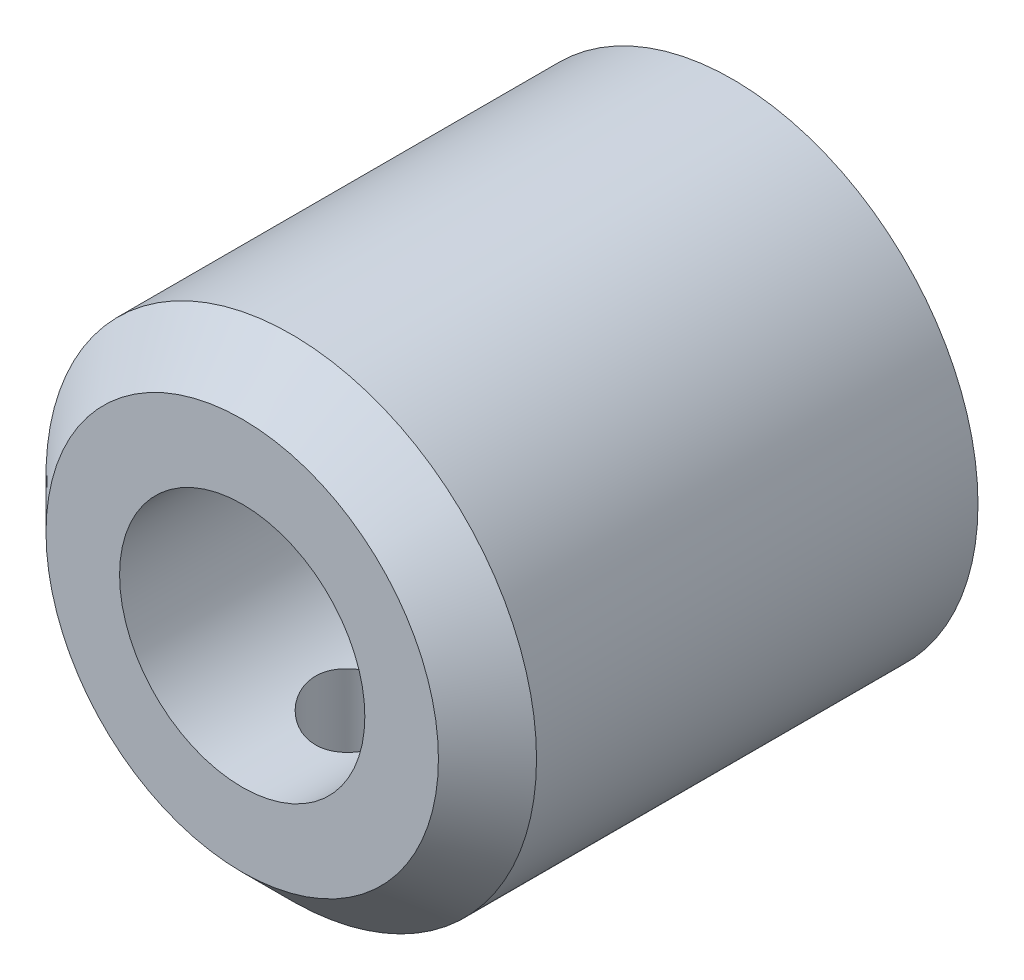
ISO-10303-21;
HEADER;
FILE_DESCRIPTION(('STEP AP214'),'2;1');
FILE_NAME('part.step','',(''),(''),'','','');
FILE_SCHEMA(('AUTOMOTIVE_DESIGN { 1 0 10303 214 1 1 1 1 }'));
ENDSEC;
DATA;
#1=APPLICATION_CONTEXT('core data for automotive mechanical design processes');
#2=APPLICATION_PROTOCOL_DEFINITION('international standard','automotive_design',2000,#1);
#3=PRODUCT_CONTEXT('',#1,'mechanical');
#4=PRODUCT('Part','Part','',(#3));
#5=PRODUCT_RELATED_PRODUCT_CATEGORY('part','',(#4));
#6=PRODUCT_DEFINITION_FORMATION('','',#4);
#7=PRODUCT_DEFINITION_CONTEXT('part definition',#1,'design');
#8=PRODUCT_DEFINITION('design','',#6,#7);
#9=PRODUCT_DEFINITION_SHAPE('','',#8);
#10=(LENGTH_UNIT() NAMED_UNIT(*) SI_UNIT(.MILLI.,.METRE.));
#11=(NAMED_UNIT(*) PLANE_ANGLE_UNIT() SI_UNIT($,.RADIAN.));
#12=(NAMED_UNIT(*) SI_UNIT($,.STERADIAN.) SOLID_ANGLE_UNIT());
#13=UNCERTAINTY_MEASURE_WITH_UNIT(LENGTH_MEASURE(1.E-05),#10,'distance_accuracy_value','');
#14=(GEOMETRIC_REPRESENTATION_CONTEXT(3) GLOBAL_UNCERTAINTY_ASSIGNED_CONTEXT((#13)) GLOBAL_UNIT_ASSIGNED_CONTEXT((#10,
#11,#12)) REPRESENTATION_CONTEXT('',''));
#15=CARTESIAN_POINT('',(0.,0.,0.));
#16=DIRECTION('',(0.,0.,1.));
#17=DIRECTION('',(1.,0.,0.));
#18=AXIS2_PLACEMENT_3D('',#15,#16,#17);
#19=CARTESIAN_POINT('',(0.,0.,0.));
#20=DIRECTION('',(0.,0.,1.));
#21=DIRECTION('',(1.,0.,0.));
#22=AXIS2_PLACEMENT_3D('',#19,#20,#21);
#23=CYLINDRICAL_SURFACE('',#22,2.5527);
#24=CARTESIAN_POINT('',(0.,0.,0.));
#25=DIRECTION('',(0.,0.,1.));
#26=DIRECTION('',(1.,0.,0.));
#27=AXIS2_PLACEMENT_3D('',#24,#25,#26);
#28=CIRCLE('',#27,2.5527);
#29=CARTESIAN_POINT('',(2.5527,0.,0.));
#30=VERTEX_POINT('',#29);
#31=EDGE_CURVE('E55',#30,#30,#28,.T.);
#32=ORIENTED_EDGE('',*,*,#31,.F.);
#33=EDGE_LOOP('',(#32));
#34=FACE_BOUND('',#33,.T.);
#35=CARTESIAN_POINT('',(0.,0.,6.35));
#36=DIRECTION('',(0.,0.,1.));
#37=DIRECTION('',(1.,0.,0.));
#38=AXIS2_PLACEMENT_3D('',#35,#36,#37);
#39=CIRCLE('',#38,2.5527);
#40=CARTESIAN_POINT('',(2.5527,0.,6.35));
#41=VERTEX_POINT('',#40);
#42=EDGE_CURVE('E52',#41,#41,#39,.F.);
#43=ORIENTED_EDGE('',*,*,#42,.F.);
#44=EDGE_LOOP('',(#43));
#45=FACE_BOUND('',#44,.T.);
#46=ADVANCED_FACE('F33',(#34,#45),#23,.F.);
#47=CARTESIAN_POINT('',(0.,0.,25.4));
#48=DIRECTION('',(0.,0.,-1.));
#49=DIRECTION('',(-1.,0.,0.));
#50=AXIS2_PLACEMENT_3D('',#47,#48,#49);
#51=CYLINDRICAL_SURFACE('',#50,12.7);
#52=CARTESIAN_POINT('',(0.,-12.7,21.6027));
#53=CARTESIAN_POINT('',(0.141856210556827,-12.6999973836125,21.6026947992652));
#54=CARTESIAN_POINT('',(0.283778014555003,-12.6975988645737,21.5908354019713));
#55=CARTESIAN_POINT('',(0.563609069212328,-12.6882620663431,21.5437494200947));
#56=CARTESIAN_POINT('',(0.701515058540079,-12.6813201991963,21.5085043671802));
#57=CARTESIAN_POINT('',(0.969228227666433,-12.6636717493926,21.4157806634625));
#58=CARTESIAN_POINT('',(1.09904306188463,-12.6529687904705,21.3583234083448));
#59=CARTESIAN_POINT('',(1.34718134295212,-12.6289612418531,21.2228701068456));
#60=CARTESIAN_POINT('',(1.46550545353774,-12.6156568025605,21.1448752477406));
#61=CARTESIAN_POINT('',(1.68892996901582,-12.5877068517561,20.9694303316011));
#62=CARTESIAN_POINT('',(1.79385064772143,-12.5730469098802,20.8717536744985));
#63=CARTESIAN_POINT('',(1.98593364961853,-12.5441430340592,20.6602049245976));
#64=CARTESIAN_POINT('',(2.07309457629733,-12.5298991329043,20.5463315593889));
#65=CARTESIAN_POINT('',(2.22795031612872,-12.503299099816,20.3043272075157));
#66=CARTESIAN_POINT('',(2.29545876345372,-12.4909615307886,20.1760747465399));
#67=CARTESIAN_POINT('',(2.40789922201017,-12.4697761123132,19.9097582831116));
#68=CARTESIAN_POINT('',(2.45283348724067,-12.4609279144755,19.7716952618011));
#69=CARTESIAN_POINT('',(2.5182660618401,-12.4478691093208,19.4916112808219));
#70=CARTESIAN_POINT('',(2.53907984994946,-12.4435986847958,19.3496668685901));
#71=CARTESIAN_POINT('',(2.556660601318,-12.4399989112979,19.064241420859));
#72=CARTESIAN_POINT('',(2.55343004860283,-12.4406690519141,18.9207605456212));
#73=CARTESIAN_POINT('',(2.52326882881564,-12.4468203533509,18.6386450774652));
#74=CARTESIAN_POINT('',(2.49670006112813,-12.4522280468367,18.4999699525371));
#75=CARTESIAN_POINT('',(2.42118795375881,-12.4671294390268,18.22908634573));
#76=CARTESIAN_POINT('',(2.37224353587668,-12.4766233346287,18.0968781758096));
#77=CARTESIAN_POINT('',(2.25302460013362,-12.4987023805749,17.8416397460598));
#78=CARTESIAN_POINT('',(2.18260685945091,-12.5113081757149,17.7186782438108));
#79=CARTESIAN_POINT('',(2.02254121619103,-12.538177441116,17.4861812029433));
#80=CARTESIAN_POINT('',(1.93289108233262,-12.5524411036294,17.3766472244626));
#81=CARTESIAN_POINT('',(1.73496896015374,-12.5813370668157,17.1720264962329));
#82=CARTESIAN_POINT('',(1.62638815322407,-12.5959713559519,17.0772384840096));
#83=CARTESIAN_POINT('',(1.39471255482946,-12.6237223479193,16.9071741129816));
#84=CARTESIAN_POINT('',(1.27161757365897,-12.6368390309105,16.8318980092457));
#85=CARTESIAN_POINT('',(1.0140743227451,-12.6601096493237,16.7029380554906));
#86=CARTESIAN_POINT('',(0.879608370826798,-12.6702588568104,16.6492886112446));
#87=CARTESIAN_POINT('',(0.603322484554135,-12.6864151381535,16.5654247810302));
#88=CARTESIAN_POINT('',(0.461503452403971,-12.6924227188899,16.5352075272173));
#89=CARTESIAN_POINT('',(0.177104051498396,-12.6995481841004,16.4994893705948));
#90=CARTESIAN_POINT('',(0.0345769867780911,-12.7007469316581,16.4935796797751));
#91=CARTESIAN_POINT('',(-0.249428046087236,-12.6983443714293,16.5055431228646));
#92=CARTESIAN_POINT('',(-0.390906073365954,-12.6947433363045,16.523414905817));
#93=CARTESIAN_POINT('',(-0.667476383491518,-12.6831964518339,16.582094396555));
#94=CARTESIAN_POINT('',(-0.802615026738495,-12.6752903990727,16.6226921154068));
#95=CARTESIAN_POINT('',(-1.06416673072534,-12.6560168288592,16.7254414059752));
#96=CARTESIAN_POINT('',(-1.19057913200878,-12.644649050149,16.7875946045411));
#97=CARTESIAN_POINT('',(-1.4328122519913,-12.6195117376563,16.9325732272068));
#98=CARTESIAN_POINT('',(-1.54848289391928,-12.6057142777796,17.0156444578398));
#99=CARTESIAN_POINT('',(-1.76438919701811,-12.5773133106478,17.1997722092937));
#100=CARTESIAN_POINT('',(-1.8646231833638,-12.562709716163,17.3008306791088));
#101=CARTESIAN_POINT('',(-2.04839058950709,-12.5340694771794,17.5199259572378));
#102=CARTESIAN_POINT('',(-2.13164324412743,-12.5200450170782,17.6382001282524));
#103=CARTESIAN_POINT('',(-2.27710130686918,-12.494410233843,17.8872939688025));
#104=CARTESIAN_POINT('',(-2.33930756146905,-12.4827998136245,18.0181131335114));
#105=CARTESIAN_POINT('',(-2.44052494151928,-12.4634063332917,18.2879217015593));
#106=CARTESIAN_POINT('',(-2.47965694875249,-12.4556033644444,18.4268642572503));
#107=CARTESIAN_POINT('',(-2.53398105268389,-12.4446663941807,18.7095263031243));
#108=CARTESIAN_POINT('',(-2.54917630665989,-12.4415317770077,18.8532451607552));
#109=CARTESIAN_POINT('',(-2.55507780348404,-12.4403208492062,19.1385606359953));
#110=CARTESIAN_POINT('',(-2.54622777717105,-12.4421528827854,19.2801478725412));
#111=CARTESIAN_POINT('',(-2.5052699101022,-12.4504639175017,19.5597712280986));
#112=CARTESIAN_POINT('',(-2.47316226034212,-12.4569428804773,19.6978073762625));
#113=CARTESIAN_POINT('',(-2.38679936908456,-12.4737765848225,19.9661242795811));
#114=CARTESIAN_POINT('',(-2.33259906402888,-12.4841217071844,20.0964233598288));
#115=CARTESIAN_POINT('',(-2.20364056330041,-12.5075274993734,20.3461477072286));
#116=CARTESIAN_POINT('',(-2.12888062178004,-12.5205883997912,20.4655720497917));
#117=CARTESIAN_POINT('',(-1.95941169836469,-12.5482342158997,20.692365302721));
#118=CARTESIAN_POINT('',(-1.86438247968974,-12.5628414330946,20.7994922447589));
#119=CARTESIAN_POINT('',(-1.65773305497646,-12.5917744882506,20.9964259525452));
#120=CARTESIAN_POINT('',(-1.54610904069973,-12.6061002607682,21.0862287317801));
#121=CARTESIAN_POINT('',(-1.30801795412702,-12.6330352312072,21.2468635898942));
#122=CARTESIAN_POINT('',(-1.18140621960531,-12.6456246451832,21.3174847101187));
#123=CARTESIAN_POINT('',(-0.917894136535642,-12.6674735086059,21.4363360028624));
#124=CARTESIAN_POINT('',(-0.781003157818661,-12.676735947189,21.4845862859573));
#125=CARTESIAN_POINT('',(-0.536510950989496,-12.6890953080047,21.5480196258905));
#126=CARTESIAN_POINT('',(-0.430298188022946,-12.6931605653143,21.568488077794));
#127=CARTESIAN_POINT('',(-0.216069596903566,-12.6986138643494,21.5958300250375));
#128=CARTESIAN_POINT('',(-0.108053827366588,-12.7000019929384,21.6027039614712));
#129=CARTESIAN_POINT('',(0.,-12.7,21.6027));
#130=B_SPLINE_CURVE_WITH_KNOTS('',3,(#52,#53,#54,#55,#56,#57,#58,#59,#60,#61,#62,#63,#64,#65,
#66,#67,#68,#69,#70,#71,#72,#73,#74,#75,#76,#77,#78,#79,#80,#81,#82,#83,#84,#85,#86,#87,#88,#89,
#90,#91,#92,#93,#94,#95,#96,#97,#98,#99,#100,#101,#102,#103,#104,#105,#106,#107,#108,#109,#110,
#111,#112,#113,#114,#115,#116,#117,#118,#119,#120,#121,#122,#123,#124,#125,#126,#127,#128,#129),
.UNSPECIFIED.,.T.,.F.,(4,2,2,2,2,2,2,2,2,2,2,2,2,2,2,2,2,2,2,2,2,2,2,2,2,2,2,2,2,2,2,2,2,2,2,2,
2,2,4),(0.,0.425173326858358,0.850682825726688,1.27578347391371,1.70085955247508,
2.13114227989732,2.56145882893966,2.99573225362805,3.42996230812813,3.85844645262255,
4.28688633094917,4.70879751785867,5.13072903726018,5.55553870266189,5.98039767981271,
6.41297793207711,6.84556383894968,7.27883525459767,7.71205363417531,8.13795588808112,
8.56383394874415,8.98584032623797,9.40787856061103,9.83512862114266,10.2624250042595,
10.6962975397844,11.1301526230408,11.5617141464938,11.9932187418526,12.416814710791,
12.8404072011225,13.2629527342799,13.6855341595118,14.1153652704349,14.545295173375,
14.9797777811894,15.4138690438584,15.7377399254777,16.0616002984631),.UNSPECIFIED.);
#131=CARTESIAN_POINT('',(0.,-12.7,21.6027));
#132=VERTEX_POINT('',#131);
#133=EDGE_CURVE('E66',#132,#132,#130,.T.);
#134=ORIENTED_EDGE('',*,*,#133,.T.);
#135=EDGE_LOOP('',(#134));
#136=FACE_BOUND('',#135,.T.);
#137=CARTESIAN_POINT('',(0.,0.,22.86));
#138=DIRECTION('',(0.,0.,1.));
#139=DIRECTION('',(1.,0.,0.));
#140=AXIS2_PLACEMENT_3D('',#137,#138,#139);
#141=CIRCLE('',#140,12.7);
#142=CARTESIAN_POINT('',(12.7,0.,22.86));
#143=VERTEX_POINT('',#142);
#144=EDGE_CURVE('E11',#143,#143,#141,.F.);
#145=ORIENTED_EDGE('',*,*,#144,.T.);
#146=EDGE_LOOP('',(#145));
#147=FACE_BOUND('',#146,.T.);
#148=CARTESIAN_POINT('',(0.,0.,0.));
#149=DIRECTION('',(0.,0.,1.));
#150=DIRECTION('',(1.,0.,0.));
#151=AXIS2_PLACEMENT_3D('',#148,#149,#150);
#152=CIRCLE('',#151,12.7);
#153=CARTESIAN_POINT('',(12.7,0.,0.));
#154=VERTEX_POINT('',#153);
#155=EDGE_CURVE('E49',#154,#154,#152,.T.);
#156=ORIENTED_EDGE('',*,*,#155,.T.);
#157=EDGE_LOOP('',(#156));
#158=FACE_BOUND('',#157,.T.);
#159=ADVANCED_FACE('F70',(#136,#147,#158),#51,.T.);
#160=CARTESIAN_POINT('',(0.,0.,25.4));
#161=DIRECTION('',(0.,0.,1.));
#162=DIRECTION('',(1.,0.,0.));
#163=AXIS2_PLACEMENT_3D('',#160,#161,#162);
#164=PLANE('',#163);
#165=CARTESIAN_POINT('',(0.,0.,25.4));
#166=DIRECTION('',(0.,0.,1.));
#167=DIRECTION('',(1.,0.,0.));
#168=AXIS2_PLACEMENT_3D('',#165,#166,#167);
#169=CIRCLE('',#168,10.16);
#170=CARTESIAN_POINT('',(10.16,0.,25.4));
#171=VERTEX_POINT('',#170);
#172=EDGE_CURVE('E45',#171,#171,#169,.T.);
#173=ORIENTED_EDGE('',*,*,#172,.T.);
#174=EDGE_LOOP('',(#173));
#175=FACE_BOUND('',#174,.T.);
#176=CARTESIAN_POINT('',(0.,0.,25.4));
#177=DIRECTION('',(0.,0.,1.));
#178=DIRECTION('',(1.,0.,0.));
#179=AXIS2_PLACEMENT_3D('',#176,#177,#178);
#180=CIRCLE('',#179,6.35);
#181=CARTESIAN_POINT('',(6.35,0.,25.4));
#182=VERTEX_POINT('',#181);
#183=EDGE_CURVE('E63',#182,#182,#180,.T.);
#184=ORIENTED_EDGE('',*,*,#183,.F.);
#185=EDGE_LOOP('',(#184));
#186=FACE_BOUND('',#185,.T.);
#187=ADVANCED_FACE('F91',(#175,#186),#164,.T.);
#188=CARTESIAN_POINT('',(0.,0.,0.));
#189=DIRECTION('',(0.,0.,1.));
#190=DIRECTION('',(1.,0.,0.));
#191=AXIS2_PLACEMENT_3D('',#188,#189,#190);
#192=PLANE('',#191);
#193=ORIENTED_EDGE('',*,*,#31,.T.);
#194=EDGE_LOOP('',(#193));
#195=FACE_BOUND('',#194,.T.);
#196=ORIENTED_EDGE('',*,*,#155,.F.);
#197=EDGE_LOOP('',(#196));
#198=FACE_BOUND('',#197,.T.);
#199=ADVANCED_FACE('F82',(#195,#198),#192,.F.);
#200=CARTESIAN_POINT('',(0.,0.,6.35));
#201=DIRECTION('',(0.,0.,1.));
#202=DIRECTION('',(1.,0.,0.));
#203=AXIS2_PLACEMENT_3D('',#200,#201,#202);
#204=PLANE('',#203);
#205=CARTESIAN_POINT('',(0.,0.,6.35));
#206=DIRECTION('',(0.,0.,1.));
#207=DIRECTION('',(1.,0.,0.));
#208=AXIS2_PLACEMENT_3D('',#205,#206,#207);
#209=CIRCLE('',#208,6.35);
#210=CARTESIAN_POINT('',(6.35,0.,6.35));
#211=VERTEX_POINT('',#210);
#212=EDGE_CURVE('E56',#211,#211,#209,.F.);
#213=ORIENTED_EDGE('',*,*,#212,.F.);
#214=EDGE_LOOP('',(#213));
#215=FACE_BOUND('',#214,.T.);
#216=ORIENTED_EDGE('',*,*,#42,.T.);
#217=EDGE_LOOP('',(#216));
#218=FACE_BOUND('',#217,.T.);
#219=ADVANCED_FACE('F78',(#215,#218),#204,.T.);
#220=CARTESIAN_POINT('',(0.,0.,-17.9605122421383));
#221=DIRECTION('',(0.,0.,1.));
#222=DIRECTION('',(1.,0.,0.));
#223=AXIS2_PLACEMENT_3D('',#220,#221,#222);
#224=CYLINDRICAL_SURFACE('',#223,6.35);
#225=CARTESIAN_POINT('',(0.,-6.35,21.6027));
#226=CARTESIAN_POINT('',(-0.137152590563423,-6.34999304806874,21.6026906610043));
#227=CARTESIAN_POINT('',(-0.274526179298313,-6.34550570854028,21.5915829020298));
#228=CARTESIAN_POINT('',(-0.545406210867716,-6.32799859624412,21.5475460334531));
#229=CARTESIAN_POINT('',(-0.678901166129098,-6.31495573589492,21.5145578755959));
#230=CARTESIAN_POINT('',(-0.937658479293741,-6.2817396684711,21.4281525565369));
#231=CARTESIAN_POINT('',(-1.06294633311217,-6.26158991981214,21.3748025586855));
#232=CARTESIAN_POINT('',(-1.30267951928129,-6.21614281942444,21.2494568808944));
#233=CARTESIAN_POINT('',(-1.41712854004813,-6.19084722809909,21.1774675752091));
#234=CARTESIAN_POINT('',(-1.63753539441426,-6.13631999828522,21.0132745572942));
#235=CARTESIAN_POINT('',(-1.74291121266193,-6.1069653774522,20.9203307098501));
#236=CARTESIAN_POINT('',(-1.93707323593065,-6.0481863895213,20.7184294727568));
#237=CARTESIAN_POINT('',(-2.02585125334072,-6.01876199521393,20.6094642269303));
#238=CARTESIAN_POINT('',(-2.18823813167984,-5.96169986279921,20.3726528553883));
#239=CARTESIAN_POINT('',(-2.26098339858475,-5.93420233969043,20.2441772723725));
#240=CARTESIAN_POINT('',(-2.3835717843574,-5.88603907626437,19.9755435433724));
#241=CARTESIAN_POINT('',(-2.43342588991176,-5.86537005992216,19.835391040005));
#242=CARTESIAN_POINT('',(-2.5064570611452,-5.83452558981196,19.5540709734665));
#243=CARTESIAN_POINT('',(-2.5307490630558,-5.82391378021108,19.4132424527024));
#244=CARTESIAN_POINT('',(-2.5554487145633,-5.81312158743501,19.1291389994587));
#245=CARTESIAN_POINT('',(-2.55586827216116,-5.81293600347311,18.9858653223451));
#246=CARTESIAN_POINT('',(-2.53365545339498,-5.82264534091095,18.7116983283649));
#247=CARTESIAN_POINT('',(-2.51264426262924,-5.83183133573759,18.5806436600116));
#248=CARTESIAN_POINT('',(-2.45087143364757,-5.85805796981581,18.324106953756));
#249=CARTESIAN_POINT('',(-2.41010631071102,-5.87509999489578,18.1986259033408));
#250=CARTESIAN_POINT('',(-2.30920424806733,-5.91549406542853,17.9537538579749));
#251=CARTESIAN_POINT('',(-2.2486869842788,-5.93896841007289,17.8345406542287));
#252=CARTESIAN_POINT('',(-2.1102657336248,-5.98954915060851,17.6075202242484));
#253=CARTESIAN_POINT('',(-2.03235517588616,-6.01665691759063,17.4997173313728));
#254=CARTESIAN_POINT('',(-1.85420353945379,-6.07402992197142,17.2897121949814));
#255=CARTESIAN_POINT('',(-1.75269319282268,-6.10437636024199,17.1886059746183));
#256=CARTESIAN_POINT('',(-1.53383712498801,-6.16300797653218,17.0044991418258));
#257=CARTESIAN_POINT('',(-1.41648819460132,-6.1912927350249,16.9215022076056));
#258=CARTESIAN_POINT('',(-1.16615109270643,-6.24333551925189,16.7745119502721));
#259=CARTESIAN_POINT('',(-1.03289559737699,-6.26699093045802,16.710934919678));
#260=CARTESIAN_POINT('',(-0.756388475795014,-6.30633251872665,16.6074783464667));
#261=CARTESIAN_POINT('',(-0.613142022475445,-6.32202278550323,16.5675866407996));
#262=CARTESIAN_POINT('',(-0.329902950281627,-6.34291864136937,16.5148588527662));
#263=CARTESIAN_POINT('',(-0.190226394779016,-6.34869410367057,16.5005500911003));
#264=CARTESIAN_POINT('',(0.0896381983188436,-6.35090754458063,16.495040914583));
#265=CARTESIAN_POINT('',(0.229826092046455,-6.3473479735458,16.5038344356061));
#266=CARTESIAN_POINT('',(0.500032677309315,-6.33166393929384,16.5432006678801));
#267=CARTESIAN_POINT('',(0.630223897491498,-6.31993636241371,16.5727646922932));
#268=CARTESIAN_POINT('',(0.883675174685732,-6.28950889121095,16.6514565226014));
#269=CARTESIAN_POINT('',(1.00693434052696,-6.27080810277367,16.7005868373676));
#270=CARTESIAN_POINT('',(1.24727618501288,-6.2275337552144,16.8186205752088));
#271=CARTESIAN_POINT('',(1.3640536406813,-6.20279772189873,16.8880840378618));
#272=CARTESIAN_POINT('',(1.58470599379151,-6.15012973013763,17.0441916682007));
#273=CARTESIAN_POINT('',(1.6885756645002,-6.12219648578789,17.1308427590182));
#274=CARTESIAN_POINT('',(1.88773053063362,-6.06386438406276,17.3256392542121));
#275=CARTESIAN_POINT('',(1.98198169049624,-6.03342530552615,17.434832538619));
#276=CARTESIAN_POINT('',(2.15108053830994,-5.97522976596369,17.6680178532942));
#277=CARTESIAN_POINT('',(2.22592489421889,-5.9474737661202,17.7920124195316));
#278=CARTESIAN_POINT('',(2.35459646292974,-5.89772885227324,18.0532292444431));
#279=CARTESIAN_POINT('',(2.40820159223358,-5.87580162831968,18.1905734880888));
#280=CARTESIAN_POINT('',(2.49110345882806,-5.84114379091714,18.4734880629558));
#281=CARTESIAN_POINT('',(2.52041838243926,-5.8284062979499,18.6190521525132));
#282=CARTESIAN_POINT('',(2.55216217304463,-5.81457137458614,18.9028908824459));
#283=CARTESIAN_POINT('',(2.55638784616149,-5.81269627568292,19.0409278763691));
#284=CARTESIAN_POINT('',(2.54256086608565,-5.81875771897435,19.3156480221416));
#285=CARTESIAN_POINT('',(2.52451110625492,-5.82669298689807,19.4523313474948));
#286=CARTESIAN_POINT('',(2.46811809715366,-5.85079208061454,19.7148105464905));
#287=CARTESIAN_POINT('',(2.43062291862309,-5.86661102925355,19.8408231926478));
#288=CARTESIAN_POINT('',(2.33720121100696,-5.90444895134406,20.0848170334503));
#289=CARTESIAN_POINT('',(2.28126958060275,-5.92646964055535,20.2027959942815));
#290=CARTESIAN_POINT('',(2.14883980056637,-5.97580512840317,20.4347808303912));
#291=CARTESIAN_POINT('',(2.07134234595151,-6.00335185546815,20.5481661300409));
#292=CARTESIAN_POINT('',(1.89943729526247,-6.05993579915211,20.7608864107359));
#293=CARTESIAN_POINT('',(1.80502450937544,-6.08897347125353,20.8602170628711));
#294=CARTESIAN_POINT('',(1.59456803133815,-6.14756260987942,21.0487143404246));
#295=CARTESIAN_POINT('',(1.47751013231652,-6.17702228110563,21.1367829479283));
#296=CARTESIAN_POINT('',(1.22920158030936,-6.23118918201762,21.2920530247367));
#297=CARTESIAN_POINT('',(1.09794438564994,-6.25589420652726,21.3592448203371));
#298=CARTESIAN_POINT('',(0.82714956024149,-6.29735329315789,21.4692995575139));
#299=CARTESIAN_POINT('',(0.687808846675046,-6.31424535261242,21.5125875994433));
#300=CARTESIAN_POINT('',(0.47458249107052,-6.33264571166289,21.5592546911802));
#301=CARTESIAN_POINT('',(0.402870618992066,-6.33762151518832,21.5717631728607));
#302=CARTESIAN_POINT('',(0.258527172772306,-6.34514446855661,21.5906139511525));
#303=CARTESIAN_POINT('',(0.185896283634988,-6.34769333043157,21.5969605945581));
#304=CARTESIAN_POINT('',(0.075454567358147,-6.34966466033005,21.6018649891317));
#305=CARTESIAN_POINT('',(0.0377356484545705,-6.35000191272825,21.6027025694962));
#306=CARTESIAN_POINT('',(0.,-6.35,21.6027));
#307=B_SPLINE_CURVE_WITH_KNOTS('',3,(#225,#226,#227,#228,#229,#230,#231,#232,#233,#234,#235,
#236,#237,#238,#239,#240,#241,#242,#243,#244,#245,#246,#247,#248,#249,#250,#251,#252,#253,#254,
#255,#256,#257,#258,#259,#260,#261,#262,#263,#264,#265,#266,#267,#268,#269,#270,#271,#272,#273,
#274,#275,#276,#277,#278,#279,#280,#281,#282,#283,#284,#285,#286,#287,#288,#289,#290,#291,#292,
#293,#294,#295,#296,#297,#298,#299,#300,#301,#302,#303,#304,#305,#306),.UNSPECIFIED.,.T.,.F.,(4,
2,2,2,2,2,2,2,2,2,2,2,2,2,2,2,2,2,2,2,2,2,2,2,2,2,2,2,2,2,2,2,2,2,2,2,2,2,2,2,4),(0.,
0.41133105951513,0.823776712244998,1.23487351245121,1.64582991138901,2.07457553263976,
2.50353209708506,2.95181404932945,3.399880621731,3.82747226722301,4.25485062050571,
4.65213393839025,5.04948736513313,5.45499402143409,5.86065413086403,6.29801539594677,
6.73546541172754,7.18172360768631,7.62775243943515,8.04716062826002,8.46645873749581,
8.86668753121309,9.26696766046538,9.67951990853173,10.092238670252,10.532473749603,
10.9727843649353,11.417584621804,11.8620515505696,12.2742621542483,12.6864192214155,
13.0819487597494,13.4775878320837,13.8960224723142,14.3145857135079,14.7606752640331,
15.2069712122026,15.6450512739017,15.863699884533,16.0821941398345,16.1953662220865),.UNSPECIFIED.);
#308=CARTESIAN_POINT('',(0.,-6.35,21.6027));
#309=VERTEX_POINT('',#308);
#310=EDGE_CURVE('E37',#309,#309,#307,.T.);
#311=ORIENTED_EDGE('',*,*,#310,.T.);
#312=EDGE_LOOP('',(#311));
#313=FACE_BOUND('',#312,.T.);
#314=ORIENTED_EDGE('',*,*,#212,.T.);
#315=EDGE_LOOP('',(#314));
#316=FACE_BOUND('',#315,.T.);
#317=ORIENTED_EDGE('',*,*,#183,.T.);
#318=EDGE_LOOP('',(#317));
#319=FACE_BOUND('',#318,.T.);
#320=ADVANCED_FACE('F81',(#313,#316,#319),#224,.F.);
#321=CARTESIAN_POINT('',(0.,0.,25.4));
#322=DIRECTION('',(0.,0.,-1.));
#323=DIRECTION('',(-1.,0.,0.));
#324=AXIS2_PLACEMENT_3D('',#321,#322,#323);
#325=CONICAL_SURFACE('',#324,10.16,0.785398163397448);
#326=ORIENTED_EDGE('',*,*,#144,.F.);
#327=EDGE_LOOP('',(#326));
#328=FACE_BOUND('',#327,.T.);
#329=ORIENTED_EDGE('',*,*,#172,.F.);
#330=EDGE_LOOP('',(#329));
#331=FACE_BOUND('',#330,.T.);
#332=ADVANCED_FACE('F35',(#328,#331),#325,.T.);
#333=CARTESIAN_POINT('',(0.,-19.05,19.05));
#334=DIRECTION('',(0.,1.,0.));
#335=DIRECTION('',(0.,0.,1.));
#336=AXIS2_PLACEMENT_3D('',#333,#334,#335);
#337=CYLINDRICAL_SURFACE('',#336,2.5527);
#338=ORIENTED_EDGE('',*,*,#310,.F.);
#339=EDGE_LOOP('',(#338));
#340=FACE_BOUND('',#339,.T.);
#341=ORIENTED_EDGE('',*,*,#133,.F.);
#342=EDGE_LOOP('',(#341));
#343=FACE_BOUND('',#342,.T.);
#344=ADVANCED_FACE('F73',(#340,#343),#337,.F.);
#345=CLOSED_SHELL('',(#46,#159,#187,#199,#219,#320,#332,#344));
#346=MANIFOLD_SOLID_BREP('B2',#345);
#347=ADVANCED_BREP_SHAPE_REPRESENTATION('',(#18,#346),#14);
#348=SHAPE_DEFINITION_REPRESENTATION(#9,#347);
ENDSEC;
END-ISO-10303-21;
